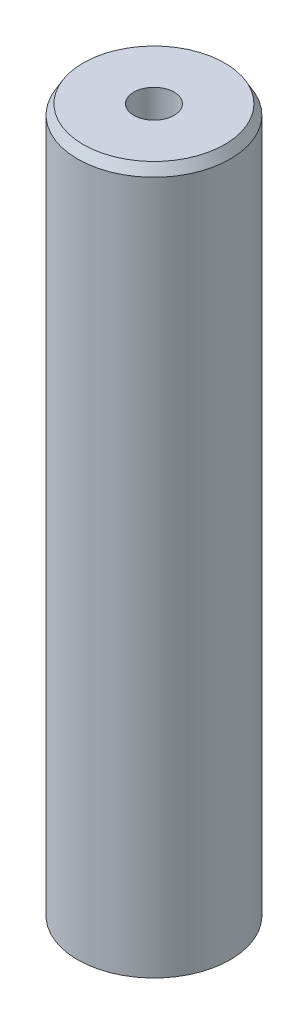
ISO-10303-21;
HEADER;
FILE_DESCRIPTION(('STEP AP214'),'2;1');
FILE_NAME('part.step','',(''),(''),'','','');
FILE_SCHEMA(('AUTOMOTIVE_DESIGN { 1 0 10303 214 1 1 1 1 }'));
ENDSEC;
DATA;
#1=APPLICATION_CONTEXT('core data for automotive mechanical design processes');
#2=APPLICATION_PROTOCOL_DEFINITION('international standard','automotive_design',2000,#1);
#3=PRODUCT_CONTEXT('',#1,'mechanical');
#4=PRODUCT('Part','Part','',(#3));
#5=PRODUCT_RELATED_PRODUCT_CATEGORY('part','',(#4));
#6=PRODUCT_DEFINITION_FORMATION('','',#4);
#7=PRODUCT_DEFINITION_CONTEXT('part definition',#1,'design');
#8=PRODUCT_DEFINITION('design','',#6,#7);
#9=PRODUCT_DEFINITION_SHAPE('','',#8);
#10=(LENGTH_UNIT() NAMED_UNIT(*) SI_UNIT(.MILLI.,.METRE.));
#11=(NAMED_UNIT(*) PLANE_ANGLE_UNIT() SI_UNIT($,.RADIAN.));
#12=(NAMED_UNIT(*) SI_UNIT($,.STERADIAN.) SOLID_ANGLE_UNIT());
#13=UNCERTAINTY_MEASURE_WITH_UNIT(LENGTH_MEASURE(1.E-05),#10,'distance_accuracy_value','');
#14=(GEOMETRIC_REPRESENTATION_CONTEXT(3) GLOBAL_UNCERTAINTY_ASSIGNED_CONTEXT((#13)) GLOBAL_UNIT_ASSIGNED_CONTEXT((#10,
#11,#12)) REPRESENTATION_CONTEXT('',''));
#15=CARTESIAN_POINT('',(0.,0.,0.));
#16=DIRECTION('',(0.,0.,1.));
#17=DIRECTION('',(1.,0.,0.));
#18=AXIS2_PLACEMENT_3D('',#15,#16,#17);
#19=CARTESIAN_POINT('',(0.,69.6352348184807,0.));
#20=DIRECTION('',(0.,-1.,0.));
#21=DIRECTION('',(0.,0.,-1.));
#22=AXIS2_PLACEMENT_3D('',#19,#20,#21);
#23=CYLINDRICAL_SURFACE('',#22,7.5);
#24=CARTESIAN_POINT('',(0.,68.6793885672249,0.));
#25=DIRECTION('',(0.,1.,0.));
#26=DIRECTION('',(0.,0.,1.));
#27=AXIS2_PLACEMENT_3D('',#24,#25,#26);
#28=CIRCLE('',#27,7.5);
#29=CARTESIAN_POINT('',(0.,68.6793885672249,7.5));
#30=VERTEX_POINT('',#29);
#31=EDGE_CURVE('E50',#30,#30,#28,.F.);
#32=ORIENTED_EDGE('',*,*,#31,.T.);
#33=EDGE_LOOP('',(#32));
#34=FACE_BOUND('',#33,.T.);
#35=CARTESIAN_POINT('',(0.,0.551858090466428,0.));
#36=DIRECTION('',(0.,1.,0.));
#37=DIRECTION('',(0.,0.,1.));
#38=AXIS2_PLACEMENT_3D('',#35,#36,#37);
#39=CIRCLE('',#38,7.5);
#40=CARTESIAN_POINT('',(0.,0.551858090466428,7.5));
#41=VERTEX_POINT('',#40);
#42=EDGE_CURVE('E51',#41,#41,#39,.T.);
#43=ORIENTED_EDGE('',*,*,#42,.T.);
#44=EDGE_LOOP('',(#43));
#45=FACE_BOUND('',#44,.T.);
#46=ADVANCED_FACE('F39',(#34,#45),#23,.T.);
#47=CARTESIAN_POINT('',(0.,69.6352348184807,0.));
#48=DIRECTION('',(0.,1.,0.));
#49=DIRECTION('',(0.,0.,1.));
#50=AXIS2_PLACEMENT_3D('',#47,#48,#49);
#51=PLANE('',#50);
#52=CARTESIAN_POINT('',(0.,69.6352348184807,0.));
#53=DIRECTION('',(0.,1.,0.));
#54=DIRECTION('',(0.,0.,1.));
#55=AXIS2_PLACEMENT_3D('',#52,#53,#54);
#56=CIRCLE('',#55,6.94814190953359);
#57=CARTESIAN_POINT('',(0.,69.6352348184807,6.94814190953359));
#58=VERTEX_POINT('',#57);
#59=EDGE_CURVE('E54',#58,#58,#56,.T.);
#60=ORIENTED_EDGE('',*,*,#59,.T.);
#61=EDGE_LOOP('',(#60));
#62=FACE_BOUND('',#61,.T.);
#63=CARTESIAN_POINT('',(0.,69.6352348184807,0.));
#64=DIRECTION('',(0.,1.,0.));
#65=DIRECTION('',(0.,0.,1.));
#66=AXIS2_PLACEMENT_3D('',#63,#64,#65);
#67=CIRCLE('',#66,1.98065326484959);
#68=CARTESIAN_POINT('',(0.,69.6352348184807,1.98065326484959));
#69=VERTEX_POINT('',#68);
#70=EDGE_CURVE('E58',#69,#69,#67,.T.);
#71=ORIENTED_EDGE('',*,*,#70,.F.);
#72=EDGE_LOOP('',(#71));
#73=FACE_BOUND('',#72,.T.);
#74=ADVANCED_FACE('F69',(#62,#73),#51,.T.);
#75=CARTESIAN_POINT('',(0.,0.,0.));
#76=DIRECTION('',(0.,1.,0.));
#77=DIRECTION('',(0.,0.,1.));
#78=AXIS2_PLACEMENT_3D('',#75,#76,#77);
#79=PLANE('',#78);
#80=CARTESIAN_POINT('',(0.,0.,0.));
#81=DIRECTION('',(0.,1.,0.));
#82=DIRECTION('',(0.,0.,1.));
#83=AXIS2_PLACEMENT_3D('',#80,#81,#82);
#84=CIRCLE('',#83,6.54415374874418);
#85=CARTESIAN_POINT('',(0.,0.,6.54415374874418));
#86=VERTEX_POINT('',#85);
#87=EDGE_CURVE('E10',#86,#86,#84,.F.);
#88=ORIENTED_EDGE('',*,*,#87,.T.);
#89=EDGE_LOOP('',(#88));
#90=FACE_BOUND('',#89,.T.);
#91=CARTESIAN_POINT('',(0.,0.,0.));
#92=DIRECTION('',(0.,1.,0.));
#93=DIRECTION('',(0.,0.,1.));
#94=AXIS2_PLACEMENT_3D('',#91,#92,#93);
#95=CIRCLE('',#94,1.98065326484959);
#96=CARTESIAN_POINT('',(0.,0.,1.98065326484959));
#97=VERTEX_POINT('',#96);
#98=EDGE_CURVE('E63',#97,#97,#95,.T.);
#99=ORIENTED_EDGE('',*,*,#98,.T.);
#100=EDGE_LOOP('',(#99));
#101=FACE_BOUND('',#100,.T.);
#102=ADVANCED_FACE('F75',(#90,#101),#79,.F.);
#103=CARTESIAN_POINT('',(0.,69.6352348184807,0.));
#104=DIRECTION('',(0.,-1.,0.));
#105=DIRECTION('',(0.,0.,-1.));
#106=AXIS2_PLACEMENT_3D('',#103,#104,#105);
#107=CYLINDRICAL_SURFACE('',#106,1.98065326484959);
#108=ORIENTED_EDGE('',*,*,#70,.T.);
#109=EDGE_LOOP('',(#108));
#110=FACE_BOUND('',#109,.T.);
#111=ORIENTED_EDGE('',*,*,#98,.F.);
#112=EDGE_LOOP('',(#111));
#113=FACE_BOUND('',#112,.T.);
#114=ADVANCED_FACE('F70',(#110,#113),#107,.F.);
#115=CARTESIAN_POINT('',(0.,69.6352348184807,0.));
#116=DIRECTION('',(0.,-1.,0.));
#117=DIRECTION('',(0.,0.,-1.));
#118=AXIS2_PLACEMENT_3D('',#115,#116,#117);
#119=CONICAL_SURFACE('',#118,6.94814190953359,0.523598775598298);
#120=ORIENTED_EDGE('',*,*,#31,.F.);
#121=EDGE_LOOP('',(#120));
#122=FACE_BOUND('',#121,.T.);
#123=ORIENTED_EDGE('',*,*,#59,.F.);
#124=EDGE_LOOP('',(#123));
#125=FACE_BOUND('',#124,.T.);
#126=ADVANCED_FACE('F81',(#122,#125),#119,.T.);
#127=CARTESIAN_POINT('',(0.,0.551858090466428,0.));
#128=DIRECTION('',(0.,1.,0.));
#129=DIRECTION('',(0.,0.,1.));
#130=AXIS2_PLACEMENT_3D('',#127,#128,#129);
#131=CONICAL_SURFACE('',#130,7.5,1.04719755119661);
#132=ORIENTED_EDGE('',*,*,#87,.F.);
#133=EDGE_LOOP('',(#132));
#134=FACE_BOUND('',#133,.T.);
#135=ORIENTED_EDGE('',*,*,#42,.F.);
#136=EDGE_LOOP('',(#135));
#137=FACE_BOUND('',#136,.T.);
#138=ADVANCED_FACE('F45',(#134,#137),#131,.T.);
#139=CLOSED_SHELL('',(#46,#74,#102,#114,#126,#138));
#140=MANIFOLD_SOLID_BREP('B2',#139);
#141=ADVANCED_BREP_SHAPE_REPRESENTATION('',(#18,#140),#14);
#142=SHAPE_DEFINITION_REPRESENTATION(#9,#141);
ENDSEC;
END-ISO-10303-21;
